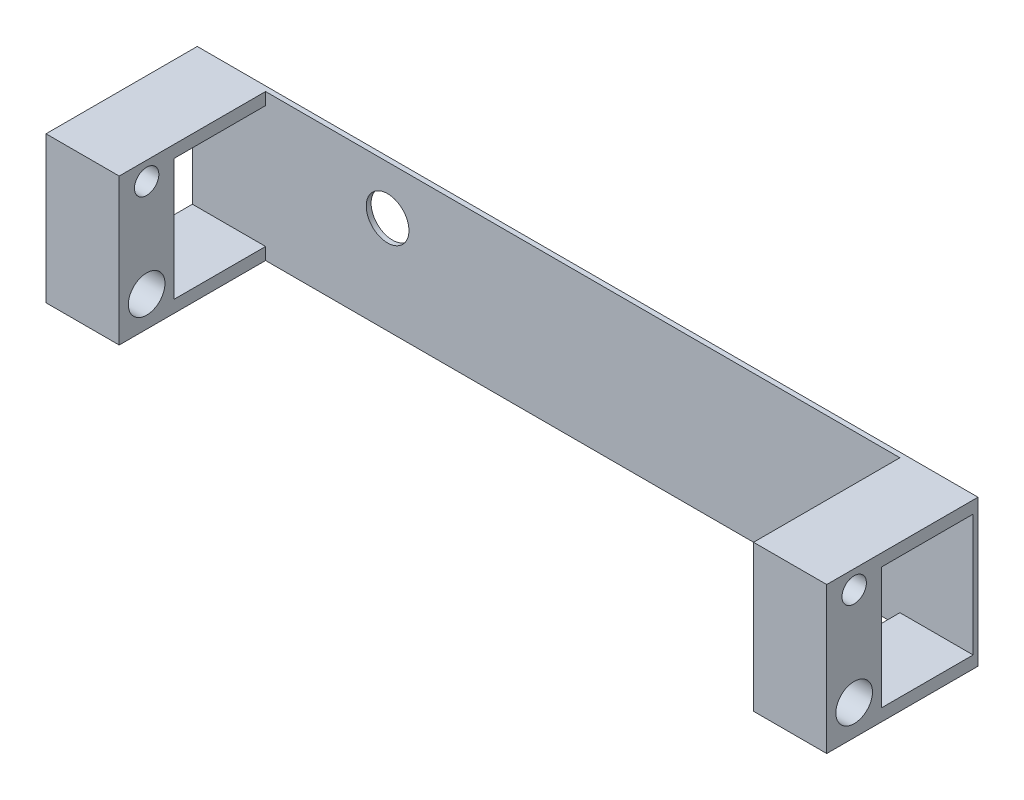
ISO-10303-21;
HEADER;
FILE_DESCRIPTION(('STEP AP214'),'2;1');
FILE_NAME('part.step','',(''),(''),'','','');
FILE_SCHEMA(('AUTOMOTIVE_DESIGN { 1 0 10303 214 1 1 1 1 }'));
ENDSEC;
DATA;
#1=APPLICATION_CONTEXT('core data for automotive mechanical design processes');
#2=APPLICATION_PROTOCOL_DEFINITION('international standard','automotive_design',2000,#1);
#3=PRODUCT_CONTEXT('',#1,'mechanical');
#4=PRODUCT('Part','Part','',(#3));
#5=PRODUCT_RELATED_PRODUCT_CATEGORY('part','',(#4));
#6=PRODUCT_DEFINITION_FORMATION('','',#4);
#7=PRODUCT_DEFINITION_CONTEXT('part definition',#1,'design');
#8=PRODUCT_DEFINITION('design','',#6,#7);
#9=PRODUCT_DEFINITION_SHAPE('','',#8);
#10=(LENGTH_UNIT() NAMED_UNIT(*) SI_UNIT(.MILLI.,.METRE.));
#11=(NAMED_UNIT(*) PLANE_ANGLE_UNIT() SI_UNIT($,.RADIAN.));
#12=(NAMED_UNIT(*) SI_UNIT($,.STERADIAN.) SOLID_ANGLE_UNIT());
#13=UNCERTAINTY_MEASURE_WITH_UNIT(LENGTH_MEASURE(1.E-05),#10,'distance_accuracy_value','');
#14=(GEOMETRIC_REPRESENTATION_CONTEXT(3) GLOBAL_UNCERTAINTY_ASSIGNED_CONTEXT((#13)) GLOBAL_UNIT_ASSIGNED_CONTEXT((#10,
#11,#12)) REPRESENTATION_CONTEXT('',''));
#15=CARTESIAN_POINT('',(0.,0.,0.));
#16=DIRECTION('',(0.,0.,1.));
#17=DIRECTION('',(1.,0.,0.));
#18=AXIS2_PLACEMENT_3D('',#15,#16,#17);
#19=CARTESIAN_POINT('',(304.8,-10.6368780177679,78.74));
#20=DIRECTION('',(0.,-1.,0.));
#21=DIRECTION('',(1.,0.,0.));
#22=AXIS2_PLACEMENT_3D('',#19,#20,#21);
#23=PLANE('',#22);
#24=DIRECTION('',(-1.,0.,0.));
#25=VECTOR('',#24,1.);
#26=CARTESIAN_POINT('',(304.8,-10.6368780177679,50.165));
#27=LINE('',#26,#25);
#28=CARTESIAN_POINT('',(304.8,-10.6368780177679,50.165));
#29=VERTEX_POINT('',#28);
#30=CARTESIAN_POINT('',(266.7,-10.6368780177679,50.165));
#31=VERTEX_POINT('',#30);
#32=EDGE_CURVE('E229',#29,#31,#27,.T.);
#33=ORIENTED_EDGE('',*,*,#32,.F.);
#34=DIRECTION('',(0.,0.,-1.));
#35=VECTOR('',#34,1.);
#36=CARTESIAN_POINT('',(304.8,-10.6368780177679,78.74));
#37=LINE('',#36,#35);
#38=CARTESIAN_POINT('',(304.8,-10.6368780177679,2.54));
#39=VERTEX_POINT('',#38);
#40=EDGE_CURVE('E298',#29,#39,#37,.T.);
#41=ORIENTED_EDGE('',*,*,#40,.T.);
#42=DIRECTION('',(-1.,0.,0.));
#43=VECTOR('',#42,1.);
#44=CARTESIAN_POINT('',(304.8,-10.6368780177679,2.54));
#45=LINE('',#44,#43);
#46=CARTESIAN_POINT('',(266.7,-10.6368780177679,2.54));
#47=VERTEX_POINT('',#46);
#48=EDGE_CURVE('E281',#39,#47,#45,.T.);
#49=ORIENTED_EDGE('',*,*,#48,.T.);
#50=DIRECTION('',(0.,0.,-1.));
#51=VECTOR('',#50,1.);
#52=CARTESIAN_POINT('',(266.7,-10.6368780177679,78.74));
#53=LINE('',#52,#51);
#54=EDGE_CURVE('E296',#31,#47,#53,.T.);
#55=ORIENTED_EDGE('',*,*,#54,.F.);
#56=EDGE_LOOP('',(#33,#41,#49,#55));
#57=FACE_BOUND('',#56,.T.);
#58=ADVANCED_FACE('F36',(#57),#23,.F.);
#59=CARTESIAN_POINT('',(304.8,52.8631219822321,78.74));
#60=DIRECTION('',(0.,1.,0.));
#61=DIRECTION('',(-1.,0.,0.));
#62=AXIS2_PLACEMENT_3D('',#59,#60,#61);
#63=PLANE('',#62);
#64=DIRECTION('',(1.,0.,0.));
#65=VECTOR('',#64,1.);
#66=CARTESIAN_POINT('',(304.8,52.8631219822321,50.165));
#67=LINE('',#66,#65);
#68=CARTESIAN_POINT('',(266.7,52.8631219822321,50.165));
#69=VERTEX_POINT('',#68);
#70=CARTESIAN_POINT('',(304.8,52.8631219822321,50.165));
#71=VERTEX_POINT('',#70);
#72=EDGE_CURVE('E11',#69,#71,#67,.T.);
#73=ORIENTED_EDGE('',*,*,#72,.F.);
#74=DIRECTION('',(0.,0.,-1.));
#75=VECTOR('',#74,1.);
#76=CARTESIAN_POINT('',(266.7,52.8631219822321,78.74));
#77=LINE('',#76,#75);
#78=CARTESIAN_POINT('',(266.7,52.8631219822321,2.54));
#79=VERTEX_POINT('',#78);
#80=EDGE_CURVE('E277',#69,#79,#77,.T.);
#81=ORIENTED_EDGE('',*,*,#80,.T.);
#82=DIRECTION('',(1.,0.,0.));
#83=VECTOR('',#82,1.);
#84=CARTESIAN_POINT('',(304.8,52.8631219822321,2.54));
#85=LINE('',#84,#83);
#86=CARTESIAN_POINT('',(304.8,52.8631219822321,2.54));
#87=VERTEX_POINT('',#86);
#88=EDGE_CURVE('E271',#79,#87,#85,.T.);
#89=ORIENTED_EDGE('',*,*,#88,.T.);
#90=DIRECTION('',(0.,0.,-1.));
#91=VECTOR('',#90,1.);
#92=CARTESIAN_POINT('',(304.8,52.8631219822321,78.74));
#93=LINE('',#92,#91);
#94=EDGE_CURVE('E270',#71,#87,#93,.T.);
#95=ORIENTED_EDGE('',*,*,#94,.F.);
#96=EDGE_LOOP('',(#73,#81,#89,#95));
#97=FACE_BOUND('',#96,.T.);
#98=ADVANCED_FACE('F342',(#97),#63,.F.);
#99=CARTESIAN_POINT('',(-101.6,52.8631219822322,78.74));
#100=DIRECTION('',(0.,1.,0.));
#101=DIRECTION('',(0.,0.,1.));
#102=AXIS2_PLACEMENT_3D('',#99,#100,#101);
#103=PLANE('',#102);
#104=DIRECTION('',(1.,0.,0.));
#105=VECTOR('',#104,1.);
#106=CARTESIAN_POINT('',(-101.6,52.8631219822322,50.165));
#107=LINE('',#106,#105);
#108=CARTESIAN_POINT('',(-101.6,52.8631219822322,50.165));
#109=VERTEX_POINT('',#108);
#110=CARTESIAN_POINT('',(-63.4999999999999,52.8631219822322,50.165));
#111=VERTEX_POINT('',#110);
#112=EDGE_CURVE('E236',#109,#111,#107,.T.);
#113=ORIENTED_EDGE('',*,*,#112,.F.);
#114=DIRECTION('',(0.,0.,-1.));
#115=VECTOR('',#114,1.);
#116=CARTESIAN_POINT('',(-101.6,52.8631219822322,78.74));
#117=LINE('',#116,#115);
#118=CARTESIAN_POINT('',(-101.6,52.8631219822322,2.54));
#119=VERTEX_POINT('',#118);
#120=EDGE_CURVE('E263',#109,#119,#117,.T.);
#121=ORIENTED_EDGE('',*,*,#120,.T.);
#122=DIRECTION('',(1.,0.,0.));
#123=VECTOR('',#122,1.);
#124=CARTESIAN_POINT('',(-101.6,52.8631219822322,2.54));
#125=LINE('',#124,#123);
#126=CARTESIAN_POINT('',(-63.4999999999999,52.8631219822322,2.54));
#127=VERTEX_POINT('',#126);
#128=EDGE_CURVE('E165',#119,#127,#125,.T.);
#129=ORIENTED_EDGE('',*,*,#128,.T.);
#130=DIRECTION('',(0.,0.,-1.));
#131=VECTOR('',#130,1.);
#132=CARTESIAN_POINT('',(-63.4999999999999,52.8631219822322,78.74));
#133=LINE('',#132,#131);
#134=EDGE_CURVE('E61',#111,#127,#133,.T.);
#135=ORIENTED_EDGE('',*,*,#134,.F.);
#136=EDGE_LOOP('',(#113,#121,#129,#135));
#137=FACE_BOUND('',#136,.T.);
#138=ADVANCED_FACE('F355',(#137),#103,.F.);
#139=CARTESIAN_POINT('',(-101.6,-10.6368780177679,78.74));
#140=DIRECTION('',(0.,-1.,0.));
#141=DIRECTION('',(0.,0.,-1.));
#142=AXIS2_PLACEMENT_3D('',#139,#140,#141);
#143=PLANE('',#142);
#144=DIRECTION('',(-1.,0.,0.));
#145=VECTOR('',#144,1.);
#146=CARTESIAN_POINT('',(-101.6,-10.6368780177679,50.165));
#147=LINE('',#146,#145);
#148=CARTESIAN_POINT('',(-63.4999999999999,-10.6368780177679,50.165));
#149=VERTEX_POINT('',#148);
#150=CARTESIAN_POINT('',(-101.6,-10.6368780177679,50.165));
#151=VERTEX_POINT('',#150);
#152=EDGE_CURVE('E45',#149,#151,#147,.T.);
#153=ORIENTED_EDGE('',*,*,#152,.F.);
#154=DIRECTION('',(0.,0.,-1.));
#155=VECTOR('',#154,1.);
#156=CARTESIAN_POINT('',(-63.4999999999999,-10.6368780177679,78.74));
#157=LINE('',#156,#155);
#158=CARTESIAN_POINT('',(-63.4999999999999,-10.6368780177679,2.54));
#159=VERTEX_POINT('',#158);
#160=EDGE_CURVE('E53',#149,#159,#157,.T.);
#161=ORIENTED_EDGE('',*,*,#160,.T.);
#162=DIRECTION('',(-1.,0.,0.));
#163=VECTOR('',#162,1.);
#164=CARTESIAN_POINT('',(-101.6,-10.6368780177679,2.54));
#165=LINE('',#164,#163);
#166=CARTESIAN_POINT('',(-101.6,-10.6368780177679,2.54));
#167=VERTEX_POINT('',#166);
#168=EDGE_CURVE('E241',#159,#167,#165,.T.);
#169=ORIENTED_EDGE('',*,*,#168,.T.);
#170=DIRECTION('',(0.,0.,-1.));
#171=VECTOR('',#170,1.);
#172=CARTESIAN_POINT('',(-101.6,-10.6368780177679,78.74));
#173=LINE('',#172,#171);
#174=EDGE_CURVE('E240',#151,#167,#173,.T.);
#175=ORIENTED_EDGE('',*,*,#174,.F.);
#176=EDGE_LOOP('',(#153,#161,#169,#175));
#177=FACE_BOUND('',#176,.T.);
#178=ADVANCED_FACE('F366',(#177),#143,.F.);
#179=CARTESIAN_POINT('',(0.,0.,2.54));
#180=DIRECTION('',(0.,0.,-1.));
#181=DIRECTION('',(-1.,0.,0.));
#182=AXIS2_PLACEMENT_3D('',#179,#180,#181);
#183=PLANE('',#182);
#184=CARTESIAN_POINT('',(0.,33.8131219822321,2.54));
#185=DIRECTION('',(0.,0.,1.));
#186=DIRECTION('',(1.,0.,0.));
#187=AXIS2_PLACEMENT_3D('',#184,#185,#186);
#188=CIRCLE('',#187,11.1125);
#189=CARTESIAN_POINT('',(11.1125000000001,33.8131219822321,2.54));
#190=VERTEX_POINT('',#189);
#191=EDGE_CURVE('E301',#190,#190,#188,.T.);
#192=ORIENTED_EDGE('',*,*,#191,.F.);
#193=EDGE_LOOP('',(#192));
#194=FACE_BOUND('',#193,.T.);
#195=ORIENTED_EDGE('',*,*,#128,.F.);
#196=DIRECTION('',(0.,1.,0.));
#197=VECTOR('',#196,1.);
#198=CARTESIAN_POINT('',(-101.6,59.2131219822321,2.54));
#199=LINE('',#198,#197);
#200=EDGE_CURVE('E177',#167,#119,#199,.T.);
#201=ORIENTED_EDGE('',*,*,#200,.F.);
#202=ORIENTED_EDGE('',*,*,#168,.F.);
#203=DIRECTION('',(0.,1.,0.));
#204=VECTOR('',#203,1.);
#205=CARTESIAN_POINT('',(-63.4999999999999,-16.9868780177679,2.54));
#206=LINE('',#205,#204);
#207=CARTESIAN_POINT('',(-63.4999999999999,-16.9868780177679,2.54));
#208=VERTEX_POINT('',#207);
#209=EDGE_CURVE('E238',#208,#159,#206,.T.);
#210=ORIENTED_EDGE('',*,*,#209,.F.);
#211=DIRECTION('',(1.,0.,0.));
#212=VECTOR('',#211,1.);
#213=CARTESIAN_POINT('',(-304.800000000005,-16.9868780177679,2.54));
#214=LINE('',#213,#212);
#215=CARTESIAN_POINT('',(266.7,-16.9868780177679,2.54));
#216=VERTEX_POINT('',#215);
#217=EDGE_CURVE('E196',#208,#216,#214,.T.);
#218=ORIENTED_EDGE('',*,*,#217,.T.);
#219=DIRECTION('',(0.,-1.,0.));
#220=VECTOR('',#219,1.);
#221=CARTESIAN_POINT('',(266.7,-16.9868780177679,2.54));
#222=LINE('',#221,#220);
#223=EDGE_CURVE('E285',#47,#216,#222,.T.);
#224=ORIENTED_EDGE('',*,*,#223,.F.);
#225=ORIENTED_EDGE('',*,*,#48,.F.);
#226=DIRECTION('',(0.,1.,0.));
#227=VECTOR('',#226,1.);
#228=CARTESIAN_POINT('',(304.8,-16.9868780177679,2.54));
#229=LINE('',#228,#227);
#230=EDGE_CURVE('E184',#39,#87,#229,.T.);
#231=ORIENTED_EDGE('',*,*,#230,.T.);
#232=ORIENTED_EDGE('',*,*,#88,.F.);
#233=DIRECTION('',(0.,-1.,0.));
#234=VECTOR('',#233,1.);
#235=CARTESIAN_POINT('',(266.7,59.2131219822321,2.54));
#236=LINE('',#235,#234);
#237=CARTESIAN_POINT('',(266.7,59.2131219822321,2.54));
#238=VERTEX_POINT('',#237);
#239=EDGE_CURVE('E266',#238,#79,#236,.T.);
#240=ORIENTED_EDGE('',*,*,#239,.F.);
#241=DIRECTION('',(-1.,0.,0.));
#242=VECTOR('',#241,1.);
#243=CARTESIAN_POINT('',(-304.800000000005,59.2131219822321,2.54));
#244=LINE('',#243,#242);
#245=CARTESIAN_POINT('',(-63.4999999999999,59.2131219822321,2.54));
#246=VERTEX_POINT('',#245);
#247=EDGE_CURVE('E188',#238,#246,#244,.T.);
#248=ORIENTED_EDGE('',*,*,#247,.T.);
#249=DIRECTION('',(0.,1.,0.));
#250=VECTOR('',#249,1.);
#251=CARTESIAN_POINT('',(-63.4999999999999,59.2131219822322,2.54));
#252=LINE('',#251,#250);
#253=EDGE_CURVE('E252',#127,#246,#252,.T.);
#254=ORIENTED_EDGE('',*,*,#253,.F.);
#255=EDGE_LOOP('',(#195,#201,#202,#210,#218,#224,#225,#231,#232,#240,#248,#254));
#256=FACE_BOUND('',#255,.T.);
#257=ADVANCED_FACE('F325',(#194,#256),#183,.F.);
#258=CARTESIAN_POINT('',(0.,0.,0.));
#259=DIRECTION('',(0.,0.,-1.));
#260=DIRECTION('',(-1.,0.,0.));
#261=AXIS2_PLACEMENT_3D('',#258,#259,#260);
#262=PLANE('',#261);
#263=DIRECTION('',(0.,1.,0.));
#264=VECTOR('',#263,1.);
#265=CARTESIAN_POINT('',(-101.6,59.2131219822321,0.));
#266=LINE('',#265,#264);
#267=CARTESIAN_POINT('',(-101.6,-16.9868780177679,0.));
#268=VERTEX_POINT('',#267);
#269=CARTESIAN_POINT('',(-101.6,59.2131219822321,0.));
#270=VERTEX_POINT('',#269);
#271=EDGE_CURVE('E169',#268,#270,#266,.T.);
#272=ORIENTED_EDGE('',*,*,#271,.T.);
#273=DIRECTION('',(-1.,0.,0.));
#274=VECTOR('',#273,1.);
#275=CARTESIAN_POINT('',(-304.800000000005,59.2131219822321,0.));
#276=LINE('',#275,#274);
#277=CARTESIAN_POINT('',(304.8,59.2131219822321,0.));
#278=VERTEX_POINT('',#277);
#279=EDGE_CURVE('E185',#278,#270,#276,.T.);
#280=ORIENTED_EDGE('',*,*,#279,.F.);
#281=DIRECTION('',(0.,1.,0.));
#282=VECTOR('',#281,1.);
#283=CARTESIAN_POINT('',(304.8,-16.9868780177679,0.));
#284=LINE('',#283,#282);
#285=CARTESIAN_POINT('',(304.8,-16.9868780177679,0.));
#286=VERTEX_POINT('',#285);
#287=EDGE_CURVE('E183',#286,#278,#284,.T.);
#288=ORIENTED_EDGE('',*,*,#287,.F.);
#289=DIRECTION('',(1.,0.,0.));
#290=VECTOR('',#289,1.);
#291=CARTESIAN_POINT('',(-304.800000000005,-16.9868780177679,0.));
#292=LINE('',#291,#290);
#293=EDGE_CURVE('E158',#268,#286,#292,.T.);
#294=ORIENTED_EDGE('',*,*,#293,.F.);
#295=EDGE_LOOP('',(#272,#280,#288,#294));
#296=FACE_BOUND('',#295,.T.);
#297=CARTESIAN_POINT('',(0.,33.8131219822321,0.));
#298=DIRECTION('',(0.,0.,1.));
#299=DIRECTION('',(1.,0.,0.));
#300=AXIS2_PLACEMENT_3D('',#297,#298,#299);
#301=CIRCLE('',#300,11.1125);
#302=CARTESIAN_POINT('',(11.1125000000001,33.8131219822321,0.));
#303=VERTEX_POINT('',#302);
#304=EDGE_CURVE('E300',#303,#303,#301,.T.);
#305=ORIENTED_EDGE('',*,*,#304,.T.);
#306=EDGE_LOOP('',(#305));
#307=FACE_BOUND('',#306,.T.);
#308=ADVANCED_FACE('F180',(#296,#307),#262,.T.);
#309=CARTESIAN_POINT('',(304.8,-16.9868780177679,2.54));
#310=DIRECTION('',(-1.,0.,0.));
#311=DIRECTION('',(0.,-1.,0.));
#312=AXIS2_PLACEMENT_3D('',#309,#310,#311);
#313=PLANE('',#312);
#314=CARTESIAN_POINT('',(304.8,-1.11187801776782,64.4525));
#315=DIRECTION('',(1.,0.,0.));
#316=DIRECTION('',(0.,1.,0.));
#317=AXIS2_PLACEMENT_3D('',#314,#315,#316);
#318=CIRCLE('',#317,9.525);
#319=CARTESIAN_POINT('',(304.8,8.41312198223218,64.4525));
#320=VERTEX_POINT('',#319);
#321=EDGE_CURVE('E201',#320,#320,#318,.T.);
#322=ORIENTED_EDGE('',*,*,#321,.F.);
#323=EDGE_LOOP('',(#322));
#324=FACE_BOUND('',#323,.T.);
#325=CARTESIAN_POINT('',(304.8,49.6881219822322,64.4525));
#326=DIRECTION('',(1.,0.,0.));
#327=DIRECTION('',(0.,1.,0.));
#328=AXIS2_PLACEMENT_3D('',#325,#326,#327);
#329=CIRCLE('',#328,6.35);
#330=CARTESIAN_POINT('',(304.8,56.0381219822322,64.4525));
#331=VERTEX_POINT('',#330);
#332=EDGE_CURVE('E176',#331,#331,#329,.T.);
#333=ORIENTED_EDGE('',*,*,#332,.F.);
#334=EDGE_LOOP('',(#333));
#335=FACE_BOUND('',#334,.T.);
#336=ORIENTED_EDGE('',*,*,#40,.F.);
#337=DIRECTION('',(0.,1.,0.));
#338=VECTOR('',#337,1.);
#339=CARTESIAN_POINT('',(304.8,59.2131219822321,50.165));
#340=LINE('',#339,#338);
#341=EDGE_CURVE('E226',#29,#71,#340,.T.);
#342=ORIENTED_EDGE('',*,*,#341,.T.);
#343=ORIENTED_EDGE('',*,*,#94,.T.);
#344=ORIENTED_EDGE('',*,*,#230,.F.);
#345=EDGE_LOOP('',(#336,#342,#343,#344));
#346=FACE_BOUND('',#345,.T.);
#347=DIRECTION('',(0.,0.,-1.));
#348=VECTOR('',#347,1.);
#349=CARTESIAN_POINT('',(304.8,59.2131219822321,2.54));
#350=LINE('',#349,#348);
#351=CARTESIAN_POINT('',(304.8,59.2131219822321,78.74));
#352=VERTEX_POINT('',#351);
#353=EDGE_CURVE('E195',#352,#278,#350,.T.);
#354=ORIENTED_EDGE('',*,*,#353,.F.);
#355=DIRECTION('',(0.,1.,0.));
#356=VECTOR('',#355,1.);
#357=CARTESIAN_POINT('',(304.8,-16.9868780177679,78.74));
#358=LINE('',#357,#356);
#359=CARTESIAN_POINT('',(304.8,-16.9868780177679,78.74));
#360=VERTEX_POINT('',#359);
#361=EDGE_CURVE('E282',#360,#352,#358,.T.);
#362=ORIENTED_EDGE('',*,*,#361,.F.);
#363=DIRECTION('',(0.,0.,-1.));
#364=VECTOR('',#363,1.);
#365=CARTESIAN_POINT('',(304.8,-16.9868780177679,2.54));
#366=LINE('',#365,#364);
#367=EDGE_CURVE('E193',#360,#286,#366,.T.);
#368=ORIENTED_EDGE('',*,*,#367,.T.);
#369=ORIENTED_EDGE('',*,*,#287,.T.);
#370=EDGE_LOOP('',(#354,#362,#368,#369));
#371=FACE_BOUND('',#370,.T.);
#372=ADVANCED_FACE('F38',(#324,#335,#346,#371),#313,.F.);
#373=CARTESIAN_POINT('',(-304.800000000005,59.2131219822321,2.54));
#374=DIRECTION('',(0.,-1.,0.));
#375=DIRECTION('',(1.,0.,0.));
#376=AXIS2_PLACEMENT_3D('',#373,#374,#375);
#377=PLANE('',#376);
#378=ORIENTED_EDGE('',*,*,#279,.T.);
#379=DIRECTION('',(0.,0.,-1.));
#380=VECTOR('',#379,1.);
#381=CARTESIAN_POINT('',(-101.6,59.2131219822321,78.74));
#382=LINE('',#381,#380);
#383=CARTESIAN_POINT('',(-101.6,59.2131219822321,78.74));
#384=VERTEX_POINT('',#383);
#385=EDGE_CURVE('E172',#384,#270,#382,.T.);
#386=ORIENTED_EDGE('',*,*,#385,.F.);
#387=DIRECTION('',(-1.,0.,0.));
#388=VECTOR('',#387,1.);
#389=CARTESIAN_POINT('',(-101.6,59.2131219822321,78.74));
#390=LINE('',#389,#388);
#391=CARTESIAN_POINT('',(-63.4999999999999,59.2131219822322,78.74));
#392=VERTEX_POINT('',#391);
#393=EDGE_CURVE('E254',#392,#384,#390,.T.);
#394=ORIENTED_EDGE('',*,*,#393,.F.);
#395=DIRECTION('',(0.,0.,-1.));
#396=VECTOR('',#395,1.);
#397=CARTESIAN_POINT('',(-63.4999999999999,59.2131219822322,78.74));
#398=LINE('',#397,#396);
#399=EDGE_CURVE('E260',#392,#246,#398,.T.);
#400=ORIENTED_EDGE('',*,*,#399,.T.);
#401=ORIENTED_EDGE('',*,*,#247,.F.);
#402=DIRECTION('',(0.,0.,-1.));
#403=VECTOR('',#402,1.);
#404=CARTESIAN_POINT('',(266.7,59.2131219822321,78.74));
#405=LINE('',#404,#403);
#406=CARTESIAN_POINT('',(266.7,59.2131219822321,78.74));
#407=VERTEX_POINT('',#406);
#408=EDGE_CURVE('E279',#407,#238,#405,.T.);
#409=ORIENTED_EDGE('',*,*,#408,.F.);
#410=DIRECTION('',(-1.,0.,0.));
#411=VECTOR('',#410,1.);
#412=CARTESIAN_POINT('',(304.8,59.2131219822321,78.74));
#413=LINE('',#412,#411);
#414=EDGE_CURVE('E267',#352,#407,#413,.T.);
#415=ORIENTED_EDGE('',*,*,#414,.F.);
#416=ORIENTED_EDGE('',*,*,#353,.T.);
#417=EDGE_LOOP('',(#378,#386,#394,#400,#401,#409,#415,#416));
#418=FACE_BOUND('',#417,.T.);
#419=ADVANCED_FACE('F333',(#418),#377,.F.);
#420=CARTESIAN_POINT('',(-304.800000000005,-16.9868780177679,2.54));
#421=DIRECTION('',(0.,1.,0.));
#422=DIRECTION('',(0.,0.,1.));
#423=AXIS2_PLACEMENT_3D('',#420,#421,#422);
#424=PLANE('',#423);
#425=DIRECTION('',(0.,0.,-1.));
#426=VECTOR('',#425,1.);
#427=CARTESIAN_POINT('',(-101.6,-16.9868780177679,78.74));
#428=LINE('',#427,#426);
#429=CARTESIAN_POINT('',(-101.6,-16.9868780177679,78.74));
#430=VERTEX_POINT('',#429);
#431=EDGE_CURVE('E154',#430,#268,#428,.T.);
#432=ORIENTED_EDGE('',*,*,#431,.T.);
#433=ORIENTED_EDGE('',*,*,#293,.T.);
#434=ORIENTED_EDGE('',*,*,#367,.F.);
#435=DIRECTION('',(1.,0.,0.));
#436=VECTOR('',#435,1.);
#437=CARTESIAN_POINT('',(304.8,-16.9868780177679,78.74));
#438=LINE('',#437,#436);
#439=CARTESIAN_POINT('',(266.7,-16.9868780177679,78.74));
#440=VERTEX_POINT('',#439);
#441=EDGE_CURVE('E287',#440,#360,#438,.T.);
#442=ORIENTED_EDGE('',*,*,#441,.F.);
#443=DIRECTION('',(0.,0.,-1.));
#444=VECTOR('',#443,1.);
#445=CARTESIAN_POINT('',(266.7,-16.9868780177679,78.74));
#446=LINE('',#445,#444);
#447=EDGE_CURVE('E290',#440,#216,#446,.T.);
#448=ORIENTED_EDGE('',*,*,#447,.T.);
#449=ORIENTED_EDGE('',*,*,#217,.F.);
#450=DIRECTION('',(0.,0.,-1.));
#451=VECTOR('',#450,1.);
#452=CARTESIAN_POINT('',(-63.4999999999999,-16.9868780177679,78.74));
#453=LINE('',#452,#451);
#454=CARTESIAN_POINT('',(-63.4999999999999,-16.9868780177679,78.74));
#455=VERTEX_POINT('',#454);
#456=EDGE_CURVE('E166',#455,#208,#453,.T.);
#457=ORIENTED_EDGE('',*,*,#456,.F.);
#458=DIRECTION('',(1.,0.,0.));
#459=VECTOR('',#458,1.);
#460=CARTESIAN_POINT('',(-101.6,-16.9868780177679,78.74));
#461=LINE('',#460,#459);
#462=EDGE_CURVE('E162',#430,#455,#461,.T.);
#463=ORIENTED_EDGE('',*,*,#462,.F.);
#464=EDGE_LOOP('',(#432,#433,#434,#442,#448,#449,#457,#463));
#465=FACE_BOUND('',#464,.T.);
#466=ADVANCED_FACE('F156',(#465),#424,.F.);
#467=CARTESIAN_POINT('',(0.,33.8131219822321,2.54));
#468=DIRECTION('',(0.,0.,-1.));
#469=DIRECTION('',(-1.,0.,0.));
#470=AXIS2_PLACEMENT_3D('',#467,#468,#469);
#471=CYLINDRICAL_SURFACE('',#470,11.1125);
#472=ORIENTED_EDGE('',*,*,#191,.T.);
#473=EDGE_LOOP('',(#472));
#474=FACE_BOUND('',#473,.T.);
#475=ORIENTED_EDGE('',*,*,#304,.F.);
#476=EDGE_LOOP('',(#475));
#477=FACE_BOUND('',#476,.T.);
#478=ADVANCED_FACE('F360',(#474,#477),#471,.F.);
#479=CARTESIAN_POINT('',(266.7,-16.9868780177679,78.74));
#480=DIRECTION('',(1.,0.,0.));
#481=DIRECTION('',(0.,0.,-1.));
#482=AXIS2_PLACEMENT_3D('',#479,#480,#481);
#483=PLANE('',#482);
#484=CARTESIAN_POINT('',(266.7,-1.11187801776779,64.4525));
#485=DIRECTION('',(1.,0.,0.));
#486=DIRECTION('',(0.,0.,-1.));
#487=AXIS2_PLACEMENT_3D('',#484,#485,#486);
#488=CIRCLE('',#487,9.525);
#489=CARTESIAN_POINT('',(266.7,-1.11187801776779,54.9275));
#490=VERTEX_POINT('',#489);
#491=EDGE_CURVE('E220',#490,#490,#488,.T.);
#492=ORIENTED_EDGE('',*,*,#491,.T.);
#493=EDGE_LOOP('',(#492));
#494=FACE_BOUND('',#493,.T.);
#495=CARTESIAN_POINT('',(266.7,49.6881219822322,64.4525));
#496=DIRECTION('',(1.,0.,0.));
#497=DIRECTION('',(0.,0.,-1.));
#498=AXIS2_PLACEMENT_3D('',#495,#496,#497);
#499=CIRCLE('',#498,6.35);
#500=CARTESIAN_POINT('',(266.7,49.6881219822322,58.1025));
#501=VERTEX_POINT('',#500);
#502=EDGE_CURVE('E205',#501,#501,#499,.T.);
#503=ORIENTED_EDGE('',*,*,#502,.T.);
#504=EDGE_LOOP('',(#503));
#505=FACE_BOUND('',#504,.T.);
#506=DIRECTION('',(0.,-1.,0.));
#507=VECTOR('',#506,1.);
#508=CARTESIAN_POINT('',(266.7,-16.9868780177679,78.74));
#509=LINE('',#508,#507);
#510=EDGE_CURVE('E284',#407,#440,#509,.T.);
#511=ORIENTED_EDGE('',*,*,#510,.F.);
#512=ORIENTED_EDGE('',*,*,#408,.T.);
#513=ORIENTED_EDGE('',*,*,#239,.T.);
#514=ORIENTED_EDGE('',*,*,#80,.F.);
#515=DIRECTION('',(0.,-1.,0.));
#516=VECTOR('',#515,1.);
#517=CARTESIAN_POINT('',(266.7,59.2131219822321,50.165));
#518=LINE('',#517,#516);
#519=EDGE_CURVE('E223',#69,#31,#518,.T.);
#520=ORIENTED_EDGE('',*,*,#519,.T.);
#521=ORIENTED_EDGE('',*,*,#54,.T.);
#522=ORIENTED_EDGE('',*,*,#223,.T.);
#523=ORIENTED_EDGE('',*,*,#447,.F.);
#524=EDGE_LOOP('',(#511,#512,#513,#514,#520,#521,#522,#523));
#525=FACE_BOUND('',#524,.T.);
#526=ADVANCED_FACE('F319',(#494,#505,#525),#483,.F.);
#527=CARTESIAN_POINT('',(0.,0.,78.74));
#528=DIRECTION('',(0.,0.,1.));
#529=DIRECTION('',(1.,0.,0.));
#530=AXIS2_PLACEMENT_3D('',#527,#528,#529);
#531=PLANE('',#530);
#532=ORIENTED_EDGE('',*,*,#361,.T.);
#533=ORIENTED_EDGE('',*,*,#414,.T.);
#534=ORIENTED_EDGE('',*,*,#510,.T.);
#535=ORIENTED_EDGE('',*,*,#441,.T.);
#536=EDGE_LOOP('',(#532,#533,#534,#535));
#537=FACE_BOUND('',#536,.T.);
#538=ADVANCED_FACE('F315',(#537),#531,.T.);
#539=CARTESIAN_POINT('',(-101.6,59.2131219822321,78.74));
#540=DIRECTION('',(1.,0.,0.));
#541=DIRECTION('',(0.,0.,-1.));
#542=AXIS2_PLACEMENT_3D('',#539,#540,#541);
#543=PLANE('',#542);
#544=ORIENTED_EDGE('',*,*,#200,.T.);
#545=ORIENTED_EDGE('',*,*,#120,.F.);
#546=DIRECTION('',(0.,-1.,0.));
#547=VECTOR('',#546,1.);
#548=CARTESIAN_POINT('',(-101.6,59.2131219822321,50.165));
#549=LINE('',#548,#547);
#550=EDGE_CURVE('E231',#109,#151,#549,.T.);
#551=ORIENTED_EDGE('',*,*,#550,.T.);
#552=ORIENTED_EDGE('',*,*,#174,.T.);
#553=EDGE_LOOP('',(#544,#545,#551,#552));
#554=FACE_BOUND('',#553,.T.);
#555=CARTESIAN_POINT('',(-101.6,-1.11187801776752,64.4525));
#556=DIRECTION('',(1.,0.,0.));
#557=DIRECTION('',(0.,0.,-1.));
#558=AXIS2_PLACEMENT_3D('',#555,#556,#557);
#559=CIRCLE('',#558,9.525);
#560=CARTESIAN_POINT('',(-101.6,-1.11187801776752,54.9275));
#561=VERTEX_POINT('',#560);
#562=EDGE_CURVE('E217',#561,#561,#559,.T.);
#563=ORIENTED_EDGE('',*,*,#562,.T.);
#564=EDGE_LOOP('',(#563));
#565=FACE_BOUND('',#564,.T.);
#566=CARTESIAN_POINT('',(-101.6,49.6881219822325,64.4525));
#567=DIRECTION('',(1.,0.,0.));
#568=DIRECTION('',(0.,0.,-1.));
#569=AXIS2_PLACEMENT_3D('',#566,#567,#568);
#570=CIRCLE('',#569,6.35);
#571=CARTESIAN_POINT('',(-101.6,49.6881219822325,58.1025));
#572=VERTEX_POINT('',#571);
#573=EDGE_CURVE('E200',#572,#572,#570,.T.);
#574=ORIENTED_EDGE('',*,*,#573,.T.);
#575=EDGE_LOOP('',(#574));
#576=FACE_BOUND('',#575,.T.);
#577=ORIENTED_EDGE('',*,*,#385,.T.);
#578=ORIENTED_EDGE('',*,*,#271,.F.);
#579=ORIENTED_EDGE('',*,*,#431,.F.);
#580=DIRECTION('',(0.,-1.,0.));
#581=VECTOR('',#580,1.);
#582=CARTESIAN_POINT('',(-101.6,59.2131219822321,78.74));
#583=LINE('',#582,#581);
#584=EDGE_CURVE('E249',#384,#430,#583,.T.);
#585=ORIENTED_EDGE('',*,*,#584,.F.);
#586=EDGE_LOOP('',(#577,#578,#579,#585));
#587=FACE_BOUND('',#586,.T.);
#588=ADVANCED_FACE('F170',(#554,#565,#576,#587),#543,.F.);
#589=CARTESIAN_POINT('',(-63.4999999999999,59.2131219822322,78.74));
#590=DIRECTION('',(-1.,0.,0.));
#591=DIRECTION('',(0.,0.,1.));
#592=AXIS2_PLACEMENT_3D('',#589,#590,#591);
#593=PLANE('',#592);
#594=CARTESIAN_POINT('',(-63.4999999999999,-1.11187801776755,64.4525));
#595=DIRECTION('',(-1.,0.,0.));
#596=DIRECTION('',(0.,0.,1.));
#597=AXIS2_PLACEMENT_3D('',#594,#595,#596);
#598=CIRCLE('',#597,9.525);
#599=CARTESIAN_POINT('',(-63.4999999999999,-1.11187801776755,73.9775));
#600=VERTEX_POINT('',#599);
#601=EDGE_CURVE('E40',#600,#600,#598,.T.);
#602=ORIENTED_EDGE('',*,*,#601,.T.);
#603=EDGE_LOOP('',(#602));
#604=FACE_BOUND('',#603,.T.);
#605=CARTESIAN_POINT('',(-63.4999999999999,49.6881219822325,64.4525));
#606=DIRECTION('',(-1.,0.,0.));
#607=DIRECTION('',(0.,0.,1.));
#608=AXIS2_PLACEMENT_3D('',#605,#606,#607);
#609=CIRCLE('',#608,6.35);
#610=CARTESIAN_POINT('',(-63.4999999999999,49.6881219822325,70.8025));
#611=VERTEX_POINT('',#610);
#612=EDGE_CURVE('E198',#611,#611,#609,.T.);
#613=ORIENTED_EDGE('',*,*,#612,.T.);
#614=EDGE_LOOP('',(#613));
#615=FACE_BOUND('',#614,.T.);
#616=DIRECTION('',(0.,1.,0.));
#617=VECTOR('',#616,1.);
#618=CARTESIAN_POINT('',(-63.4999999999999,59.2131219822322,78.74));
#619=LINE('',#618,#617);
#620=EDGE_CURVE('E251',#455,#392,#619,.T.);
#621=ORIENTED_EDGE('',*,*,#620,.F.);
#622=ORIENTED_EDGE('',*,*,#456,.T.);
#623=ORIENTED_EDGE('',*,*,#209,.T.);
#624=ORIENTED_EDGE('',*,*,#160,.F.);
#625=DIRECTION('',(0.,1.,0.));
#626=VECTOR('',#625,1.);
#627=CARTESIAN_POINT('',(-63.4999999999999,59.2131219822321,50.165));
#628=LINE('',#627,#626);
#629=EDGE_CURVE('E234',#149,#111,#628,.T.);
#630=ORIENTED_EDGE('',*,*,#629,.T.);
#631=ORIENTED_EDGE('',*,*,#134,.T.);
#632=ORIENTED_EDGE('',*,*,#253,.T.);
#633=ORIENTED_EDGE('',*,*,#399,.F.);
#634=EDGE_LOOP('',(#621,#622,#623,#624,#630,#631,#632,#633));
#635=FACE_BOUND('',#634,.T.);
#636=ADVANCED_FACE('F327',(#604,#615,#635),#593,.F.);
#637=CARTESIAN_POINT('',(0.,0.,78.74));
#638=DIRECTION('',(0.,0.,1.));
#639=DIRECTION('',(1.,0.,0.));
#640=AXIS2_PLACEMENT_3D('',#637,#638,#639);
#641=PLANE('',#640);
#642=ORIENTED_EDGE('',*,*,#584,.T.);
#643=ORIENTED_EDGE('',*,*,#462,.T.);
#644=ORIENTED_EDGE('',*,*,#620,.T.);
#645=ORIENTED_EDGE('',*,*,#393,.T.);
#646=EDGE_LOOP('',(#642,#643,#644,#645));
#647=FACE_BOUND('',#646,.T.);
#648=ADVANCED_FACE('F331',(#647),#641,.T.);
#649=CARTESIAN_POINT('',(0.,0.,50.165));
#650=DIRECTION('',(0.,0.,1.));
#651=DIRECTION('',(1.,0.,0.));
#652=AXIS2_PLACEMENT_3D('',#649,#650,#651);
#653=PLANE('',#652);
#654=ORIENTED_EDGE('',*,*,#550,.F.);
#655=ORIENTED_EDGE('',*,*,#112,.T.);
#656=ORIENTED_EDGE('',*,*,#629,.F.);
#657=ORIENTED_EDGE('',*,*,#152,.T.);
#658=EDGE_LOOP('',(#654,#655,#656,#657));
#659=FACE_BOUND('',#658,.T.);
#660=ADVANCED_FACE('F429',(#659),#653,.F.);
#661=CARTESIAN_POINT('',(0.,0.,50.165));
#662=DIRECTION('',(0.,0.,1.));
#663=DIRECTION('',(1.,0.,0.));
#664=AXIS2_PLACEMENT_3D('',#661,#662,#663);
#665=PLANE('',#664);
#666=ORIENTED_EDGE('',*,*,#341,.F.);
#667=ORIENTED_EDGE('',*,*,#32,.T.);
#668=ORIENTED_EDGE('',*,*,#519,.F.);
#669=ORIENTED_EDGE('',*,*,#72,.T.);
#670=EDGE_LOOP('',(#666,#667,#668,#669));
#671=FACE_BOUND('',#670,.T.);
#672=ADVANCED_FACE('F344',(#671),#665,.F.);
#673=CARTESIAN_POINT('',(-304.800000000005,49.6881219822326,64.4525));
#674=DIRECTION('',(1.,0.,0.));
#675=DIRECTION('',(0.,1.,0.));
#676=AXIS2_PLACEMENT_3D('',#673,#674,#675);
#677=CYLINDRICAL_SURFACE('',#676,6.35);
#678=ORIENTED_EDGE('',*,*,#612,.F.);
#679=EDGE_LOOP('',(#678));
#680=FACE_BOUND('',#679,.T.);
#681=ORIENTED_EDGE('',*,*,#573,.F.);
#682=EDGE_LOOP('',(#681));
#683=FACE_BOUND('',#682,.T.);
#684=ADVANCED_FACE('F387',(#680,#683),#677,.F.);
#685=CARTESIAN_POINT('',(-304.800000000005,-1.11187801776737,64.4525));
#686=DIRECTION('',(1.,0.,0.));
#687=DIRECTION('',(0.,1.,0.));
#688=AXIS2_PLACEMENT_3D('',#685,#686,#687);
#689=CYLINDRICAL_SURFACE('',#688,9.525);
#690=ORIENTED_EDGE('',*,*,#601,.F.);
#691=EDGE_LOOP('',(#690));
#692=FACE_BOUND('',#691,.T.);
#693=ORIENTED_EDGE('',*,*,#562,.F.);
#694=EDGE_LOOP('',(#693));
#695=FACE_BOUND('',#694,.T.);
#696=ADVANCED_FACE('F385',(#692,#695),#689,.F.);
#697=ORIENTED_EDGE('',*,*,#332,.T.);
#698=EDGE_LOOP('',(#697));
#699=FACE_BOUND('',#698,.T.);
#700=ORIENTED_EDGE('',*,*,#502,.F.);
#701=EDGE_LOOP('',(#700));
#702=FACE_BOUND('',#701,.T.);
#703=ADVANCED_FACE('F381',(#699,#702),#677,.F.);
#704=ORIENTED_EDGE('',*,*,#321,.T.);
#705=EDGE_LOOP('',(#704));
#706=FACE_BOUND('',#705,.T.);
#707=ORIENTED_EDGE('',*,*,#491,.F.);
#708=EDGE_LOOP('',(#707));
#709=FACE_BOUND('',#708,.T.);
#710=ADVANCED_FACE('F384',(#706,#709),#689,.F.);
#711=CLOSED_SHELL('',(#58,#98,#138,#178,#257,#308,#372,#419,#466,#478,#526,#538,#588,#636,#648,
#660,#672,#684,#696,#703,#710));
#712=MANIFOLD_SOLID_BREP('B2',#711);
#713=ADVANCED_BREP_SHAPE_REPRESENTATION('',(#18,#712),#14);
#714=SHAPE_DEFINITION_REPRESENTATION(#9,#713);
ENDSEC;
END-ISO-10303-21;
